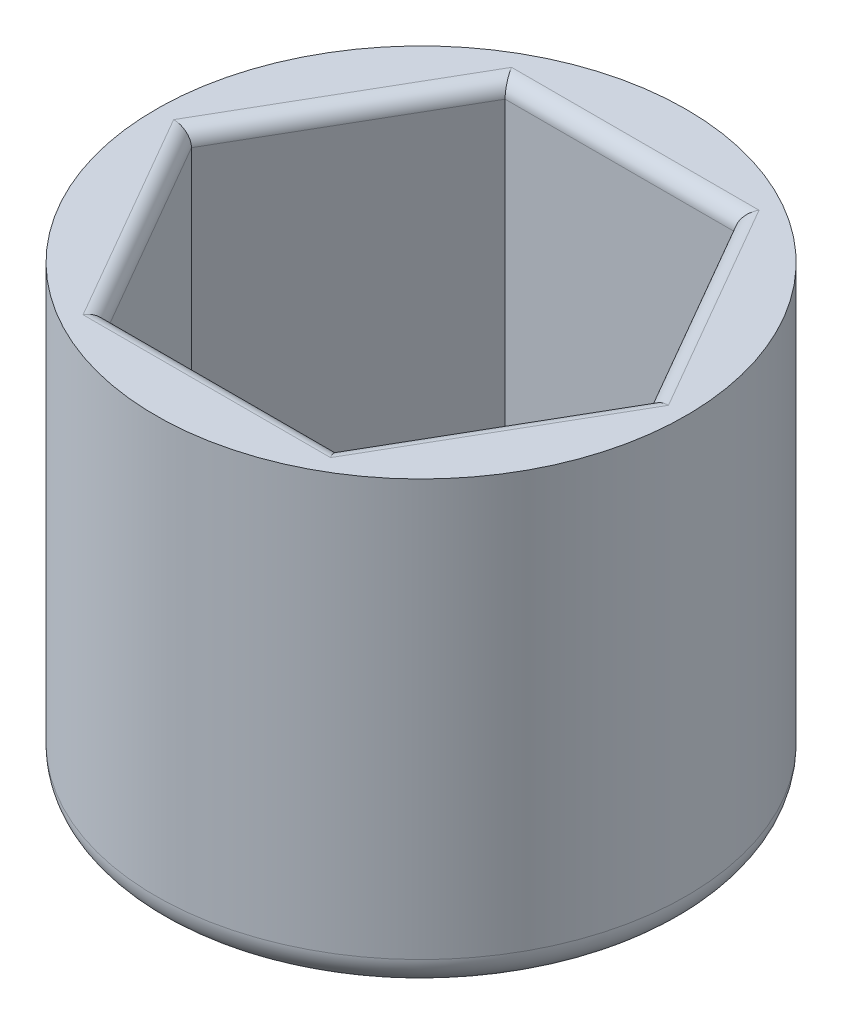
ISO-10303-21;
HEADER;
FILE_DESCRIPTION(('STEP AP214'),'2;1');
FILE_NAME('part.step','',(''),(''),'','','');
FILE_SCHEMA(('AUTOMOTIVE_DESIGN { 1 0 10303 214 1 1 1 1 }'));
ENDSEC;
DATA;
#1=APPLICATION_CONTEXT('core data for automotive mechanical design processes');
#2=APPLICATION_PROTOCOL_DEFINITION('international standard','automotive_design',2000,#1);
#3=PRODUCT_CONTEXT('',#1,'mechanical');
#4=PRODUCT('Part','Part','',(#3));
#5=PRODUCT_RELATED_PRODUCT_CATEGORY('part','',(#4));
#6=PRODUCT_DEFINITION_FORMATION('','',#4);
#7=PRODUCT_DEFINITION_CONTEXT('part definition',#1,'design');
#8=PRODUCT_DEFINITION('design','',#6,#7);
#9=PRODUCT_DEFINITION_SHAPE('','',#8);
#10=(LENGTH_UNIT() NAMED_UNIT(*) SI_UNIT(.MILLI.,.METRE.));
#11=(NAMED_UNIT(*) PLANE_ANGLE_UNIT() SI_UNIT($,.RADIAN.));
#12=(NAMED_UNIT(*) SI_UNIT($,.STERADIAN.) SOLID_ANGLE_UNIT());
#13=UNCERTAINTY_MEASURE_WITH_UNIT(LENGTH_MEASURE(1.E-05),#10,'distance_accuracy_value','');
#14=(GEOMETRIC_REPRESENTATION_CONTEXT(3) GLOBAL_UNCERTAINTY_ASSIGNED_CONTEXT((#13)) GLOBAL_UNIT_ASSIGNED_CONTEXT((#10,
#11,#12)) REPRESENTATION_CONTEXT('',''));
#15=CARTESIAN_POINT('',(0.,0.,0.));
#16=DIRECTION('',(0.,0.,1.));
#17=DIRECTION('',(1.,0.,0.));
#18=AXIS2_PLACEMENT_3D('',#15,#16,#17);
#19=CARTESIAN_POINT('',(0.,12.,0.));
#20=DIRECTION('',(0.,1.,0.));
#21=DIRECTION('',(0.,0.,1.));
#22=AXIS2_PLACEMENT_3D('',#19,#20,#21);
#23=PLANE('',#22);
#24=DIRECTION('',(0.5,0.,-0.866025403784439));
#25=VECTOR('',#24,1.);
#26=CARTESIAN_POINT('',(6.01887655630185,12.,3.475));
#27=LINE('',#26,#25);
#28=CARTESIAN_POINT('',(8.0251687417358,12.,0.));
#29=VERTEX_POINT('',#28);
#30=CARTESIAN_POINT('',(4.0125843708679,12.,6.95));
#31=VERTEX_POINT('',#30);
#32=EDGE_CURVE('E146',#29,#31,#27,.F.);
#33=ORIENTED_EDGE('',*,*,#32,.T.);
#34=DIRECTION('',(1.,0.,0.));
#35=VECTOR('',#34,1.);
#36=CARTESIAN_POINT('',(0.,12.,6.95));
#37=LINE('',#36,#35);
#38=CARTESIAN_POINT('',(-4.0125843708679,12.,6.95));
#39=VERTEX_POINT('',#38);
#40=EDGE_CURVE('E156',#31,#39,#37,.F.);
#41=ORIENTED_EDGE('',*,*,#40,.T.);
#42=DIRECTION('',(0.5,0.,0.866025403784439));
#43=VECTOR('',#42,1.);
#44=CARTESIAN_POINT('',(-6.01887655630185,12.,3.475));
#45=LINE('',#44,#43);
#46=CARTESIAN_POINT('',(-8.0251687417358,12.,0.));
#47=VERTEX_POINT('',#46);
#48=EDGE_CURVE('E154',#39,#47,#45,.F.);
#49=ORIENTED_EDGE('',*,*,#48,.T.);
#50=DIRECTION('',(-0.5,0.,0.866025403784439));
#51=VECTOR('',#50,1.);
#52=CARTESIAN_POINT('',(-6.01887655630185,12.,-3.475));
#53=LINE('',#52,#51);
#54=CARTESIAN_POINT('',(-4.0125843708679,12.,-6.95));
#55=VERTEX_POINT('',#54);
#56=EDGE_CURVE('E152',#47,#55,#53,.F.);
#57=ORIENTED_EDGE('',*,*,#56,.T.);
#58=DIRECTION('',(-1.,0.,0.));
#59=VECTOR('',#58,1.);
#60=CARTESIAN_POINT('',(0.,12.,-6.95));
#61=LINE('',#60,#59);
#62=CARTESIAN_POINT('',(4.0125843708679,12.,-6.95));
#63=VERTEX_POINT('',#62);
#64=EDGE_CURVE('E150',#55,#63,#61,.F.);
#65=ORIENTED_EDGE('',*,*,#64,.T.);
#66=DIRECTION('',(-0.5,0.,-0.866025403784439));
#67=VECTOR('',#66,1.);
#68=CARTESIAN_POINT('',(6.01887655630185,12.,-3.475));
#69=LINE('',#68,#67);
#70=EDGE_CURVE('E148',#63,#29,#69,.F.);
#71=ORIENTED_EDGE('',*,*,#70,.T.);
#72=EDGE_LOOP('',(#33,#41,#49,#57,#65,#71));
#73=FACE_BOUND('',#72,.T.);
#74=CARTESIAN_POINT('',(0.,12.,0.));
#75=DIRECTION('',(0.,1.,0.));
#76=DIRECTION('',(0.,0.,1.));
#77=AXIS2_PLACEMENT_3D('',#74,#75,#76);
#78=CIRCLE('',#77,8.60251901092542);
#79=CARTESIAN_POINT('',(0.,12.,-8.60251901092542));
#80=VERTEX_POINT('',#79);
#81=EDGE_CURVE('E170',#80,#80,#78,.F.);
#82=ORIENTED_EDGE('',*,*,#81,.F.);
#83=EDGE_LOOP('',(#82));
#84=FACE_BOUND('',#83,.T.);
#85=ADVANCED_FACE('F35',(#73,#84),#23,.T.);
#86=CARTESIAN_POINT('',(3.72390923627309,12.,-6.45));
#87=DIRECTION('',(0.,0.,1.));
#88=DIRECTION('',(1.,0.,0.));
#89=AXIS2_PLACEMENT_3D('',#86,#87,#88);
#90=PLANE('',#89);
#91=DIRECTION('',(0.,-1.,0.));
#92=VECTOR('',#91,1.);
#93=CARTESIAN_POINT('',(3.72390923627309,12.,-6.45));
#94=LINE('',#93,#92);
#95=CARTESIAN_POINT('',(3.72390923627309,11.5,-6.45));
#96=VERTEX_POINT('',#95);
#97=CARTESIAN_POINT('',(3.72390923627309,0.,-6.45));
#98=VERTEX_POINT('',#97);
#99=EDGE_CURVE('E105',#96,#98,#94,.T.);
#100=ORIENTED_EDGE('',*,*,#99,.F.);
#101=DIRECTION('',(-1.,0.,0.));
#102=VECTOR('',#101,1.);
#103=CARTESIAN_POINT('',(3.72390923627309,11.5,-6.45));
#104=LINE('',#103,#102);
#105=CARTESIAN_POINT('',(-3.72390923627309,11.5,-6.45));
#106=VERTEX_POINT('',#105);
#107=EDGE_CURVE('E163',#96,#106,#104,.T.);
#108=ORIENTED_EDGE('',*,*,#107,.T.);
#109=DIRECTION('',(0.,-1.,0.));
#110=VECTOR('',#109,1.);
#111=CARTESIAN_POINT('',(-3.72390923627309,12.,-6.45));
#112=LINE('',#111,#110);
#113=CARTESIAN_POINT('',(-3.72390923627309,0.,-6.45));
#114=VERTEX_POINT('',#113);
#115=EDGE_CURVE('E119',#106,#114,#112,.T.);
#116=ORIENTED_EDGE('',*,*,#115,.T.);
#117=DIRECTION('',(-1.,0.,0.));
#118=VECTOR('',#117,1.);
#119=CARTESIAN_POINT('',(3.72390923627309,0.,-6.45));
#120=LINE('',#119,#118);
#121=EDGE_CURVE('E116',#98,#114,#120,.T.);
#122=ORIENTED_EDGE('',*,*,#121,.F.);
#123=EDGE_LOOP('',(#100,#108,#116,#122));
#124=FACE_BOUND('',#123,.T.);
#125=ADVANCED_FACE('F117',(#124),#90,.T.);
#126=CARTESIAN_POINT('',(-3.72390923627309,12.,-6.45));
#127=DIRECTION('',(0.866025403784438,0.,0.5));
#128=DIRECTION('',(0.5,0.,-0.866025403784439));
#129=AXIS2_PLACEMENT_3D('',#126,#127,#128);
#130=PLANE('',#129);
#131=ORIENTED_EDGE('',*,*,#115,.F.);
#132=DIRECTION('',(-0.5,0.,0.866025403784439));
#133=VECTOR('',#132,1.);
#134=CARTESIAN_POINT('',(-3.72390923627309,11.5,-6.45));
#135=LINE('',#134,#133);
#136=CARTESIAN_POINT('',(-7.44781847254617,11.5,0.));
#137=VERTEX_POINT('',#136);
#138=EDGE_CURVE('E161',#106,#137,#135,.T.);
#139=ORIENTED_EDGE('',*,*,#138,.T.);
#140=DIRECTION('',(0.,-1.,0.));
#141=VECTOR('',#140,1.);
#142=CARTESIAN_POINT('',(-7.44781847254617,12.,0.));
#143=LINE('',#142,#141);
#144=CARTESIAN_POINT('',(-7.44781847254617,0.,0.));
#145=VERTEX_POINT('',#144);
#146=EDGE_CURVE('E140',#137,#145,#143,.T.);
#147=ORIENTED_EDGE('',*,*,#146,.T.);
#148=DIRECTION('',(-0.5,0.,0.866025403784439));
#149=VECTOR('',#148,1.);
#150=CARTESIAN_POINT('',(-3.72390923627309,0.,-6.45));
#151=LINE('',#150,#149);
#152=EDGE_CURVE('E123',#114,#145,#151,.T.);
#153=ORIENTED_EDGE('',*,*,#152,.F.);
#154=EDGE_LOOP('',(#131,#139,#147,#153));
#155=FACE_BOUND('',#154,.T.);
#156=ADVANCED_FACE('F203',(#155),#130,.T.);
#157=CARTESIAN_POINT('',(-7.44781847254617,12.,0.));
#158=DIRECTION('',(0.866025403784439,0.,-0.5));
#159=DIRECTION('',(-0.5,0.,-0.866025403784439));
#160=AXIS2_PLACEMENT_3D('',#157,#158,#159);
#161=PLANE('',#160);
#162=ORIENTED_EDGE('',*,*,#146,.F.);
#163=DIRECTION('',(0.5,0.,0.866025403784439));
#164=VECTOR('',#163,1.);
#165=CARTESIAN_POINT('',(-7.44781847254617,11.5,0.));
#166=LINE('',#165,#164);
#167=CARTESIAN_POINT('',(-3.72390923627308,11.5,6.45));
#168=VERTEX_POINT('',#167);
#169=EDGE_CURVE('E159',#137,#168,#166,.T.);
#170=ORIENTED_EDGE('',*,*,#169,.T.);
#171=DIRECTION('',(0.,-1.,0.));
#172=VECTOR('',#171,1.);
#173=CARTESIAN_POINT('',(-3.72390923627308,12.,6.45));
#174=LINE('',#173,#172);
#175=CARTESIAN_POINT('',(-3.72390923627308,0.,6.45));
#176=VERTEX_POINT('',#175);
#177=EDGE_CURVE('E138',#168,#176,#174,.T.);
#178=ORIENTED_EDGE('',*,*,#177,.T.);
#179=DIRECTION('',(0.5,0.,0.866025403784438));
#180=VECTOR('',#179,1.);
#181=CARTESIAN_POINT('',(-7.44781847254617,0.,0.));
#182=LINE('',#181,#180);
#183=EDGE_CURVE('E256',#145,#176,#182,.T.);
#184=ORIENTED_EDGE('',*,*,#183,.F.);
#185=EDGE_LOOP('',(#162,#170,#178,#184));
#186=FACE_BOUND('',#185,.T.);
#187=ADVANCED_FACE('F250',(#186),#161,.T.);
#188=CARTESIAN_POINT('',(-3.72390923627308,12.,6.45));
#189=DIRECTION('',(0.,0.,-1.));
#190=DIRECTION('',(-1.,0.,0.));
#191=AXIS2_PLACEMENT_3D('',#188,#189,#190);
#192=PLANE('',#191);
#193=ORIENTED_EDGE('',*,*,#177,.F.);
#194=DIRECTION('',(1.,0.,0.));
#195=VECTOR('',#194,1.);
#196=CARTESIAN_POINT('',(-3.72390923627308,11.5,6.45));
#197=LINE('',#196,#195);
#198=CARTESIAN_POINT('',(3.72390923627309,11.5,6.45));
#199=VERTEX_POINT('',#198);
#200=EDGE_CURVE('E143',#168,#199,#197,.T.);
#201=ORIENTED_EDGE('',*,*,#200,.T.);
#202=DIRECTION('',(0.,-1.,0.));
#203=VECTOR('',#202,1.);
#204=CARTESIAN_POINT('',(3.72390923627309,12.,6.45));
#205=LINE('',#204,#203);
#206=CARTESIAN_POINT('',(3.72390923627309,0.,6.45));
#207=VERTEX_POINT('',#206);
#208=EDGE_CURVE('E136',#199,#207,#205,.T.);
#209=ORIENTED_EDGE('',*,*,#208,.T.);
#210=DIRECTION('',(1.,0.,0.));
#211=VECTOR('',#210,1.);
#212=CARTESIAN_POINT('',(-3.72390923627308,0.,6.45));
#213=LINE('',#212,#211);
#214=EDGE_CURVE('E131',#176,#207,#213,.T.);
#215=ORIENTED_EDGE('',*,*,#214,.F.);
#216=EDGE_LOOP('',(#193,#201,#209,#215));
#217=FACE_BOUND('',#216,.T.);
#218=ADVANCED_FACE('F254',(#217),#192,.T.);
#219=CARTESIAN_POINT('',(3.72390923627309,12.,6.45));
#220=DIRECTION('',(-0.866025403784438,0.,-0.5));
#221=DIRECTION('',(-0.5,0.,0.866025403784439));
#222=AXIS2_PLACEMENT_3D('',#219,#220,#221);
#223=PLANE('',#222);
#224=ORIENTED_EDGE('',*,*,#208,.F.);
#225=DIRECTION('',(0.5,0.,-0.866025403784439));
#226=VECTOR('',#225,1.);
#227=CARTESIAN_POINT('',(3.72390923627309,11.5,6.45));
#228=LINE('',#227,#226);
#229=CARTESIAN_POINT('',(7.44781847254617,11.5,0.));
#230=VERTEX_POINT('',#229);
#231=EDGE_CURVE('E50',#199,#230,#228,.T.);
#232=ORIENTED_EDGE('',*,*,#231,.T.);
#233=DIRECTION('',(0.,-1.,0.));
#234=VECTOR('',#233,1.);
#235=CARTESIAN_POINT('',(7.44781847254617,12.,0.));
#236=LINE('',#235,#234);
#237=CARTESIAN_POINT('',(7.44781847254617,0.,0.));
#238=VERTEX_POINT('',#237);
#239=EDGE_CURVE('E113',#230,#238,#236,.T.);
#240=ORIENTED_EDGE('',*,*,#239,.T.);
#241=DIRECTION('',(0.5,0.,-0.866025403784439));
#242=VECTOR('',#241,1.);
#243=CARTESIAN_POINT('',(3.72390923627309,0.,6.45));
#244=LINE('',#243,#242);
#245=EDGE_CURVE('E129',#207,#238,#244,.T.);
#246=ORIENTED_EDGE('',*,*,#245,.F.);
#247=EDGE_LOOP('',(#224,#232,#240,#246));
#248=FACE_BOUND('',#247,.T.);
#249=ADVANCED_FACE('F272',(#248),#223,.T.);
#250=CARTESIAN_POINT('',(7.44781847254617,12.,0.));
#251=DIRECTION('',(-0.866025403784439,0.,0.5));
#252=DIRECTION('',(0.5,0.,0.866025403784439));
#253=AXIS2_PLACEMENT_3D('',#250,#251,#252);
#254=PLANE('',#253);
#255=ORIENTED_EDGE('',*,*,#239,.F.);
#256=DIRECTION('',(-0.5,0.,-0.866025403784439));
#257=VECTOR('',#256,1.);
#258=CARTESIAN_POINT('',(7.44781847254617,11.5,0.));
#259=LINE('',#258,#257);
#260=EDGE_CURVE('E57',#230,#96,#259,.T.);
#261=ORIENTED_EDGE('',*,*,#260,.T.);
#262=ORIENTED_EDGE('',*,*,#99,.T.);
#263=DIRECTION('',(-0.5,0.,-0.866025403784438));
#264=VECTOR('',#263,1.);
#265=CARTESIAN_POINT('',(7.44781847254617,0.,0.));
#266=LINE('',#265,#264);
#267=EDGE_CURVE('E109',#238,#98,#266,.T.);
#268=ORIENTED_EDGE('',*,*,#267,.F.);
#269=EDGE_LOOP('',(#255,#261,#262,#268));
#270=FACE_BOUND('',#269,.T.);
#271=ADVANCED_FACE('F107',(#270),#254,.T.);
#272=CARTESIAN_POINT('',(0.,0.,0.));
#273=DIRECTION('',(0.,-1.,0.));
#274=DIRECTION('',(0.,0.,-1.));
#275=AXIS2_PLACEMENT_3D('',#272,#273,#274);
#276=PLANE('',#275);
#277=ORIENTED_EDGE('',*,*,#267,.T.);
#278=ORIENTED_EDGE('',*,*,#121,.T.);
#279=ORIENTED_EDGE('',*,*,#152,.T.);
#280=ORIENTED_EDGE('',*,*,#183,.T.);
#281=ORIENTED_EDGE('',*,*,#214,.T.);
#282=ORIENTED_EDGE('',*,*,#245,.T.);
#283=EDGE_LOOP('',(#277,#278,#279,#280,#281,#282));
#284=FACE_BOUND('',#283,.T.);
#285=ADVANCED_FACE('F126',(#284),#276,.F.);
#286=CARTESIAN_POINT('',(0.,-2.5,0.));
#287=DIRECTION('',(0.,-1.,0.));
#288=DIRECTION('',(0.,0.,-1.));
#289=AXIS2_PLACEMENT_3D('',#286,#287,#288);
#290=PLANE('',#289);
#291=CARTESIAN_POINT('',(0.,-2.5,0.));
#292=DIRECTION('',(0.,-1.,0.));
#293=DIRECTION('',(0.,0.,-1.));
#294=AXIS2_PLACEMENT_3D('',#291,#292,#293);
#295=CIRCLE('',#294,7.60251901092542);
#296=CARTESIAN_POINT('',(0.,-2.5,-7.60251901092542));
#297=VERTEX_POINT('',#296);
#298=EDGE_CURVE('E43',#297,#297,#295,.T.);
#299=ORIENTED_EDGE('',*,*,#298,.T.);
#300=EDGE_LOOP('',(#299));
#301=FACE_BOUND('',#300,.T.);
#302=ADVANCED_FACE('F185',(#301),#290,.T.);
#303=CARTESIAN_POINT('',(3.72390923627309,11.5,-6.95));
#304=DIRECTION('',(-1.,0.,0.));
#305=DIRECTION('',(0.,0.,1.));
#306=AXIS2_PLACEMENT_3D('',#303,#304,#305);
#307=CYLINDRICAL_SURFACE('',#306,0.5);
#308=CARTESIAN_POINT('',(4.0125843708679,11.5,-6.95));
#309=DIRECTION('',(-0.866025403784439,0.,-0.5));
#310=DIRECTION('',(-0.5,0.,0.866025403784439));
#311=AXIS2_PLACEMENT_3D('',#308,#309,#310);
#312=ELLIPSE('',#311,0.577350269189626,0.5);
#313=EDGE_CURVE('E178',#63,#96,#312,.F.);
#314=ORIENTED_EDGE('',*,*,#313,.F.);
#315=ORIENTED_EDGE('',*,*,#64,.F.);
#316=CARTESIAN_POINT('',(-4.0125843708679,11.5,-6.95));
#317=DIRECTION('',(-0.866025403784439,0.,0.5));
#318=DIRECTION('',(0.5,0.,0.866025403784439));
#319=AXIS2_PLACEMENT_3D('',#316,#317,#318);
#320=ELLIPSE('',#319,0.577350269189626,0.5);
#321=EDGE_CURVE('E124',#106,#55,#320,.T.);
#322=ORIENTED_EDGE('',*,*,#321,.F.);
#323=ORIENTED_EDGE('',*,*,#107,.F.);
#324=EDGE_LOOP('',(#314,#315,#322,#323));
#325=FACE_BOUND('',#324,.T.);
#326=ADVANCED_FACE('F225',(#325),#307,.T.);
#327=CARTESIAN_POINT('',(-4.1569219381653,11.5,-6.7));
#328=DIRECTION('',(-0.5,0.,0.866025403784439));
#329=DIRECTION('',(0.866025403784439,0.,0.5));
#330=AXIS2_PLACEMENT_3D('',#327,#328,#329);
#331=CYLINDRICAL_SURFACE('',#330,0.5);
#332=ORIENTED_EDGE('',*,*,#321,.T.);
#333=ORIENTED_EDGE('',*,*,#56,.F.);
#334=CARTESIAN_POINT('',(-8.0251687417358,11.5,0.));
#335=DIRECTION('',(0.,0.,1.));
#336=DIRECTION('',(1.,0.,0.));
#337=AXIS2_PLACEMENT_3D('',#334,#335,#336);
#338=ELLIPSE('',#337,0.577350269189626,0.5);
#339=EDGE_CURVE('E175',#137,#47,#338,.T.);
#340=ORIENTED_EDGE('',*,*,#339,.F.);
#341=ORIENTED_EDGE('',*,*,#138,.F.);
#342=EDGE_LOOP('',(#332,#333,#340,#341));
#343=FACE_BOUND('',#342,.T.);
#344=ADVANCED_FACE('F222',(#343),#331,.T.);
#345=CARTESIAN_POINT('',(7.88083117443839,11.5,-0.25));
#346=DIRECTION('',(-0.5,0.,-0.866025403784439));
#347=DIRECTION('',(-0.866025403784439,0.,0.5));
#348=AXIS2_PLACEMENT_3D('',#345,#346,#347);
#349=CYLINDRICAL_SURFACE('',#348,0.5);
#350=ORIENTED_EDGE('',*,*,#313,.T.);
#351=ORIENTED_EDGE('',*,*,#260,.F.);
#352=CARTESIAN_POINT('',(8.0251687417358,11.5,0.));
#353=DIRECTION('',(0.,0.,-1.));
#354=DIRECTION('',(-1.,0.,0.));
#355=AXIS2_PLACEMENT_3D('',#352,#353,#354);
#356=ELLIPSE('',#355,0.577350269189626,0.5);
#357=EDGE_CURVE('E172',#29,#230,#356,.F.);
#358=ORIENTED_EDGE('',*,*,#357,.F.);
#359=ORIENTED_EDGE('',*,*,#70,.F.);
#360=EDGE_LOOP('',(#350,#351,#358,#359));
#361=FACE_BOUND('',#360,.T.);
#362=ADVANCED_FACE('F218',(#361),#349,.T.);
#363=CARTESIAN_POINT('',(-7.88083117443839,11.5,0.249999999999999));
#364=DIRECTION('',(0.5,0.,0.866025403784439));
#365=DIRECTION('',(0.866025403784439,0.,-0.5));
#366=AXIS2_PLACEMENT_3D('',#363,#364,#365);
#367=CYLINDRICAL_SURFACE('',#366,0.5);
#368=ORIENTED_EDGE('',*,*,#339,.T.);
#369=ORIENTED_EDGE('',*,*,#48,.F.);
#370=CARTESIAN_POINT('',(-4.01258437086789,11.5,6.95));
#371=DIRECTION('',(0.866025403784439,0.,0.5));
#372=DIRECTION('',(0.5,0.,-0.866025403784439));
#373=AXIS2_PLACEMENT_3D('',#370,#371,#372);
#374=ELLIPSE('',#373,0.577350269189626,0.5);
#375=EDGE_CURVE('E169',#168,#39,#374,.T.);
#376=ORIENTED_EDGE('',*,*,#375,.F.);
#377=ORIENTED_EDGE('',*,*,#169,.F.);
#378=EDGE_LOOP('',(#368,#369,#376,#377));
#379=FACE_BOUND('',#378,.T.);
#380=ADVANCED_FACE('F214',(#379),#367,.T.);
#381=CARTESIAN_POINT('',(4.15692193816531,11.5,6.7));
#382=DIRECTION('',(0.5,0.,-0.866025403784439));
#383=DIRECTION('',(-0.866025403784439,0.,-0.5));
#384=AXIS2_PLACEMENT_3D('',#381,#382,#383);
#385=CYLINDRICAL_SURFACE('',#384,0.5);
#386=ORIENTED_EDGE('',*,*,#357,.T.);
#387=ORIENTED_EDGE('',*,*,#231,.F.);
#388=CARTESIAN_POINT('',(4.0125843708679,11.5,6.95));
#389=DIRECTION('',(0.866025403784439,0.,-0.5));
#390=DIRECTION('',(0.5,0.,0.866025403784439));
#391=AXIS2_PLACEMENT_3D('',#388,#389,#390);
#392=ELLIPSE('',#391,0.577350269189626,0.5);
#393=EDGE_CURVE('E167',#31,#199,#392,.F.);
#394=ORIENTED_EDGE('',*,*,#393,.F.);
#395=ORIENTED_EDGE('',*,*,#32,.F.);
#396=EDGE_LOOP('',(#386,#387,#394,#395));
#397=FACE_BOUND('',#396,.T.);
#398=ADVANCED_FACE('F210',(#397),#385,.T.);
#399=CARTESIAN_POINT('',(-3.72390923627308,11.5,6.95));
#400=DIRECTION('',(1.,0.,0.));
#401=DIRECTION('',(0.,0.,-1.));
#402=AXIS2_PLACEMENT_3D('',#399,#400,#401);
#403=CYLINDRICAL_SURFACE('',#402,0.5);
#404=ORIENTED_EDGE('',*,*,#375,.T.);
#405=ORIENTED_EDGE('',*,*,#40,.F.);
#406=ORIENTED_EDGE('',*,*,#393,.T.);
#407=ORIENTED_EDGE('',*,*,#200,.F.);
#408=EDGE_LOOP('',(#404,#405,#406,#407));
#409=FACE_BOUND('',#408,.T.);
#410=ADVANCED_FACE('F193',(#409),#403,.T.);
#411=CARTESIAN_POINT('',(0.,20.6793797822124,0.));
#412=DIRECTION('',(0.,-1.,0.));
#413=DIRECTION('',(0.,0.,-1.));
#414=AXIS2_PLACEMENT_3D('',#411,#412,#413);
#415=CYLINDRICAL_SURFACE('',#414,8.60251901092542);
#416=CARTESIAN_POINT('',(0.,-1.5,0.));
#417=DIRECTION('',(0.,-1.,0.));
#418=DIRECTION('',(0.,0.,-1.));
#419=AXIS2_PLACEMENT_3D('',#416,#417,#418);
#420=CIRCLE('',#419,8.60251901092542);
#421=CARTESIAN_POINT('',(0.,-1.5,-8.60251901092542));
#422=VERTEX_POINT('',#421);
#423=EDGE_CURVE('E11',#422,#422,#420,.F.);
#424=CARTESIAN_POINT('',(0.,-1.5,-8.60251901092542));
#425=CARTESIAN_POINT('',(0.,-1.359375,-8.60251901092542));
#426=CARTESIAN_POINT('',(0.,-1.21875,-8.60251901092542));
#427=CARTESIAN_POINT('',(0.,-0.937499999999999,-8.60251901092542));
#428=CARTESIAN_POINT('',(0.,-0.796874999999998,-8.60251901092542));
#429=CARTESIAN_POINT('',(0.,-0.515624999999998,-8.60251901092542));
#430=CARTESIAN_POINT('',(0.,-0.374999999999998,-8.60251901092542));
#431=CARTESIAN_POINT('',(0.,-0.0937499999999978,-8.60251901092542));
#432=CARTESIAN_POINT('',(0.,0.0468750000000029,-8.60251901092542));
#433=CARTESIAN_POINT('',(0.,0.328125000000003,-8.60251901092542));
#434=CARTESIAN_POINT('',(0.,0.468750000000003,-8.60251901092542));
#435=CARTESIAN_POINT('',(0.,0.750000000000002,-8.60251901092542));
#436=CARTESIAN_POINT('',(0.,0.890625000000001,-8.60251901092542));
#437=CARTESIAN_POINT('',(0.,1.171875,-8.60251901092542));
#438=CARTESIAN_POINT('',(0.,1.3125,-8.60251901092542));
#439=CARTESIAN_POINT('',(0.,1.59375,-8.60251901092542));
#440=CARTESIAN_POINT('',(0.,1.734375,-8.60251901092542));
#441=CARTESIAN_POINT('',(0.,2.015625,-8.60251901092542));
#442=CARTESIAN_POINT('',(0.,2.15625,-8.60251901092542));
#443=CARTESIAN_POINT('',(0.,2.4375,-8.60251901092542));
#444=CARTESIAN_POINT('',(0.,2.578125,-8.60251901092542));
#445=CARTESIAN_POINT('',(0.,2.859375,-8.60251901092542));
#446=CARTESIAN_POINT('',(0.,3.,-8.60251901092542));
#447=CARTESIAN_POINT('',(0.,3.28125,-8.60251901092542));
#448=CARTESIAN_POINT('',(0.,3.421875,-8.60251901092542));
#449=CARTESIAN_POINT('',(0.,3.703125,-8.60251901092542));
#450=CARTESIAN_POINT('',(0.,3.84375,-8.60251901092542));
#451=CARTESIAN_POINT('',(0.,4.125,-8.60251901092542));
#452=CARTESIAN_POINT('',(0.,4.265625,-8.60251901092542));
#453=CARTESIAN_POINT('',(0.,4.546875,-8.60251901092542));
#454=CARTESIAN_POINT('',(0.,4.6875,-8.60251901092542));
#455=CARTESIAN_POINT('',(0.,4.96875,-8.60251901092542));
#456=CARTESIAN_POINT('',(0.,5.109375,-8.60251901092542));
#457=CARTESIAN_POINT('',(0.,5.390625,-8.60251901092542));
#458=CARTESIAN_POINT('',(0.,5.53125,-8.60251901092542));
#459=CARTESIAN_POINT('',(0.,5.8125,-8.60251901092542));
#460=CARTESIAN_POINT('',(0.,5.953125,-8.60251901092542));
#461=CARTESIAN_POINT('',(0.,6.234375,-8.60251901092542));
#462=CARTESIAN_POINT('',(0.,6.375,-8.60251901092542));
#463=CARTESIAN_POINT('',(0.,6.65625,-8.60251901092542));
#464=CARTESIAN_POINT('',(0.,6.796875,-8.60251901092542));
#465=CARTESIAN_POINT('',(0.,7.078125,-8.60251901092542));
#466=CARTESIAN_POINT('',(0.,7.21875,-8.60251901092542));
#467=CARTESIAN_POINT('',(0.,7.5,-8.60251901092542));
#468=CARTESIAN_POINT('',(0.,7.640625,-8.60251901092542));
#469=CARTESIAN_POINT('',(0.,7.921875,-8.60251901092542));
#470=CARTESIAN_POINT('',(0.,8.0625,-8.60251901092542));
#471=CARTESIAN_POINT('',(0.,8.34375,-8.60251901092542));
#472=CARTESIAN_POINT('',(0.,8.484375,-8.60251901092542));
#473=CARTESIAN_POINT('',(0.,8.765625,-8.60251901092542));
#474=CARTESIAN_POINT('',(0.,8.90625,-8.60251901092542));
#475=CARTESIAN_POINT('',(0.,9.1875,-8.60251901092542));
#476=CARTESIAN_POINT('',(0.,9.328125,-8.60251901092542));
#477=CARTESIAN_POINT('',(0.,9.609375,-8.60251901092542));
#478=CARTESIAN_POINT('',(0.,9.75,-8.60251901092542));
#479=CARTESIAN_POINT('',(0.,10.03125,-8.60251901092542));
#480=CARTESIAN_POINT('',(0.,10.171875,-8.60251901092542));
#481=CARTESIAN_POINT('',(0.,10.453125,-8.60251901092542));
#482=CARTESIAN_POINT('',(0.,10.59375,-8.60251901092542));
#483=CARTESIAN_POINT('',(0.,10.875,-8.60251901092542));
#484=CARTESIAN_POINT('',(0.,11.015625,-8.60251901092542));
#485=CARTESIAN_POINT('',(0.,11.296875,-8.60251901092542));
#486=CARTESIAN_POINT('',(0.,11.4375,-8.60251901092542));
#487=CARTESIAN_POINT('',(0.,11.71875,-8.60251901092542));
#488=CARTESIAN_POINT('',(0.,11.859375,-8.60251901092542));
#489=CARTESIAN_POINT('',(0.,12.,-8.60251901092542));
#490=B_SPLINE_CURVE_WITH_KNOTS('',3,(#424,#425,#426,#427,#428,#429,#430,#431,#432,#433,#434,
#435,#436,#437,#438,#439,#440,#441,#442,#443,#444,#445,#446,#447,#448,#449,#450,#451,#452,#453,
#454,#455,#456,#457,#458,#459,#460,#461,#462,#463,#464,#465,#466,#467,#468,#469,#470,#471,#472,
#473,#474,#475,#476,#477,#478,#479,#480,#481,#482,#483,#484,#485,#486,#487,#488,#489),
.UNSPECIFIED.,.F.,.F.,(4,2,2,2,2,2,2,2,2,2,2,2,2,2,2,2,2,2,2,2,2,2,2,2,2,2,2,2,2,2,2,2,4),(0.,
0.421874999999999,0.843750000000001,1.265625,1.6875,2.109375,2.53125,2.953125,3.375,3.796875,
4.21875,4.640625,5.0625,5.484375,5.90625,6.328125,6.75,7.171875,7.59375,8.015625,8.4375,
8.859375,9.28125,9.703125,10.125,10.546875,10.96875,11.390625,11.8125,12.234375,12.65625,
13.078125,13.5),.UNSPECIFIED.);
#491=EDGE_CURVE('BSEAM188',#422,#80,#490,.T.);
#492=ORIENTED_EDGE('',*,*,#423,.T.);
#493=ORIENTED_EDGE('',*,*,#81,.T.);
#494=ORIENTED_EDGE('',*,*,#491,.T.);
#495=ORIENTED_EDGE('',*,*,#491,.F.);
#496=EDGE_LOOP('',(#492,#494,#493,#495));
#497=FACE_BOUND('',#496,.T.);
#498=ADVANCED_FACE('F188',(#497),#415,.T.);
#499=CARTESIAN_POINT('',(0.,-1.5,0.));
#500=DIRECTION('',(0.,-1.,0.));
#501=DIRECTION('',(0.,0.,-1.));
#502=AXIS2_PLACEMENT_3D('',#499,#500,#501);
#503=TOROIDAL_SURFACE('',#502,7.60251901092542,1.);
#504=ORIENTED_EDGE('',*,*,#423,.F.);
#505=EDGE_LOOP('',(#504));
#506=FACE_BOUND('',#505,.T.);
#507=ORIENTED_EDGE('',*,*,#298,.F.);
#508=EDGE_LOOP('',(#507));
#509=FACE_BOUND('',#508,.T.);
#510=ADVANCED_FACE('F37',(#506,#509),#503,.T.);
#511=CLOSED_SHELL('',(#85,#125,#156,#187,#218,#249,#271,#285,#302,#326,#344,#362,#380,#398,#410,
#498,#510));
#512=MANIFOLD_SOLID_BREP('B2',#511);
#513=ADVANCED_BREP_SHAPE_REPRESENTATION('',(#18,#512),#14);
#514=SHAPE_DEFINITION_REPRESENTATION(#9,#513);
ENDSEC;
END-ISO-10303-21;
